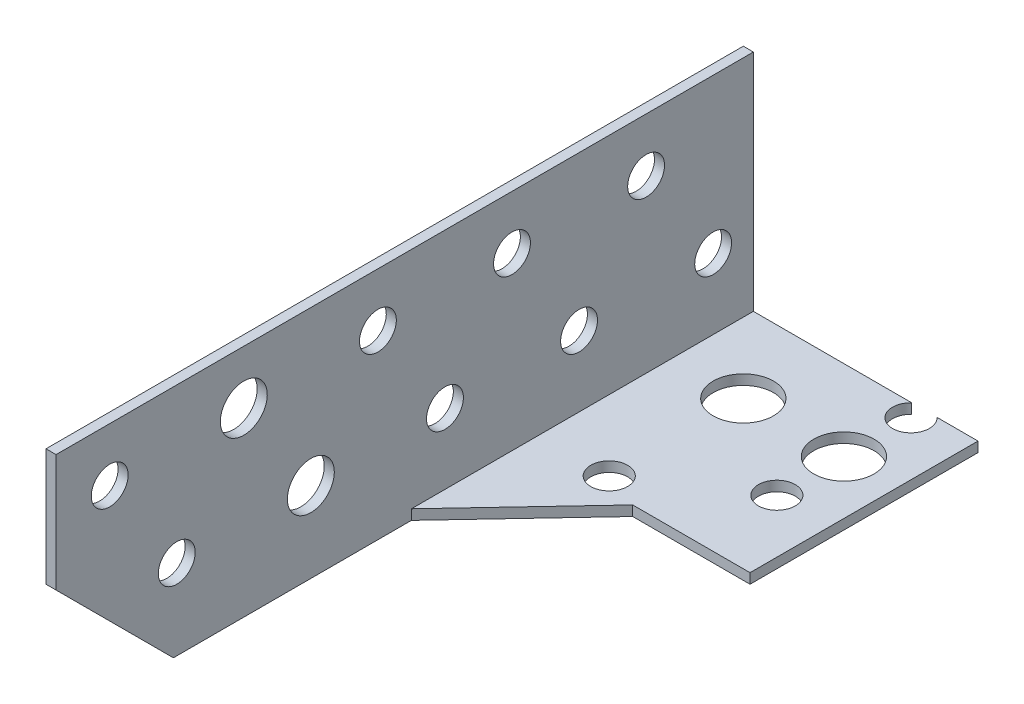
ISO-10303-21;
HEADER;
FILE_DESCRIPTION(('STEP AP214'),'2;1');
FILE_NAME('part.step','',(''),(''),'','','');
FILE_SCHEMA(('AUTOMOTIVE_DESIGN { 1 0 10303 214 1 1 1 1 }'));
ENDSEC;
DATA;
#1=APPLICATION_CONTEXT('core data for automotive mechanical design processes');
#2=APPLICATION_PROTOCOL_DEFINITION('international standard','automotive_design',2000,#1);
#3=PRODUCT_CONTEXT('',#1,'mechanical');
#4=PRODUCT('Part','Part','',(#3));
#5=PRODUCT_RELATED_PRODUCT_CATEGORY('part','',(#4));
#6=PRODUCT_DEFINITION_FORMATION('','',#4);
#7=PRODUCT_DEFINITION_CONTEXT('part definition',#1,'design');
#8=PRODUCT_DEFINITION('design','',#6,#7);
#9=PRODUCT_DEFINITION_SHAPE('','',#8);
#10=(LENGTH_UNIT() NAMED_UNIT(*) SI_UNIT(.MILLI.,.METRE.));
#11=(NAMED_UNIT(*) PLANE_ANGLE_UNIT() SI_UNIT($,.RADIAN.));
#12=(NAMED_UNIT(*) SI_UNIT($,.STERADIAN.) SOLID_ANGLE_UNIT());
#13=UNCERTAINTY_MEASURE_WITH_UNIT(LENGTH_MEASURE(1.E-05),#10,'distance_accuracy_value','');
#14=(GEOMETRIC_REPRESENTATION_CONTEXT(3) GLOBAL_UNCERTAINTY_ASSIGNED_CONTEXT((#13)) GLOBAL_UNIT_ASSIGNED_CONTEXT((#10,
#11,#12)) REPRESENTATION_CONTEXT('',''));
#15=CARTESIAN_POINT('',(0.,0.,0.));
#16=DIRECTION('',(0.,0.,1.));
#17=DIRECTION('',(1.,0.,0.));
#18=AXIS2_PLACEMENT_3D('',#15,#16,#17);
#19=CARTESIAN_POINT('',(52.75,0.,210.));
#20=DIRECTION('',(0.,-0.707106781186547,0.707106781186548));
#21=DIRECTION('',(0.,-0.707106781186548,-0.707106781186547));
#22=AXIS2_PLACEMENT_3D('',#19,#20,#21);
#23=PLANE('',#22);
#24=DIRECTION('',(0.,-0.707106781186548,-0.707106781186547));
#25=VECTOR('',#24,1.);
#26=CARTESIAN_POINT('',(-0.75,0.,210.));
#27=LINE('',#26,#25);
#28=CARTESIAN_POINT('',(-0.750000000000001,0.,210.));
#29=VERTEX_POINT('',#28);
#30=CARTESIAN_POINT('',(-0.750000000000001,-17.5,192.5));
#31=VERTEX_POINT('',#30);
#32=EDGE_CURVE('E331',#29,#31,#27,.T.);
#33=ORIENTED_EDGE('',*,*,#32,.T.);
#34=DIRECTION('',(-1.,0.,0.));
#35=VECTOR('',#34,1.);
#36=CARTESIAN_POINT('',(52.75,-17.5,192.5));
#37=LINE('',#36,#35);
#38=CARTESIAN_POINT('',(0.750000000000001,-17.5,192.5));
#39=VERTEX_POINT('',#38);
#40=EDGE_CURVE('E323',#39,#31,#37,.T.);
#41=ORIENTED_EDGE('',*,*,#40,.F.);
#42=DIRECTION('',(0.,-0.707106781186548,-0.707106781186547));
#43=VECTOR('',#42,1.);
#44=CARTESIAN_POINT('',(0.75,0.,210.));
#45=LINE('',#44,#43);
#46=CARTESIAN_POINT('',(0.75,0.,210.));
#47=VERTEX_POINT('',#46);
#48=EDGE_CURVE('E327',#47,#39,#45,.T.);
#49=ORIENTED_EDGE('',*,*,#48,.F.);
#50=DIRECTION('',(1.,0.,0.));
#51=VECTOR('',#50,1.);
#52=CARTESIAN_POINT('',(0.,0.,210.));
#53=LINE('',#52,#51);
#54=EDGE_CURVE('E187',#29,#47,#53,.T.);
#55=ORIENTED_EDGE('',*,*,#54,.F.);
#56=EDGE_LOOP('',(#33,#41,#49,#55));
#57=FACE_BOUND('',#56,.T.);
#58=ADVANCED_FACE('F46',(#57),#23,.T.);
#59=CARTESIAN_POINT('',(-51.25,9.50000000000085,122.));
#60=DIRECTION('',(1.,0.,0.));
#61=DIRECTION('',(0.,1.,0.));
#62=AXIS2_PLACEMENT_3D('',#59,#60,#61);
#63=CYLINDRICAL_SURFACE('',#62,2.75000000000002);
#64=CARTESIAN_POINT('',(0.749999999999999,9.50000000000086,122.));
#65=DIRECTION('',(1.,0.,0.));
#66=DIRECTION('',(0.,-1.,0.));
#67=AXIS2_PLACEMENT_3D('',#64,#65,#66);
#68=CIRCLE('',#67,2.75000000000002);
#69=CARTESIAN_POINT('',(0.749999999999999,6.75000000000084,122.));
#70=VERTEX_POINT('',#69);
#71=EDGE_CURVE('E259',#70,#70,#68,.T.);
#72=ORIENTED_EDGE('',*,*,#71,.T.);
#73=EDGE_LOOP('',(#72));
#74=FACE_BOUND('',#73,.T.);
#75=CARTESIAN_POINT('',(-0.750000000000001,9.50000000000086,122.));
#76=DIRECTION('',(1.,0.,0.));
#77=DIRECTION('',(0.,1.,0.));
#78=AXIS2_PLACEMENT_3D('',#75,#76,#77);
#79=CIRCLE('',#78,2.75000000000002);
#80=CARTESIAN_POINT('',(-0.750000000000001,12.2500000000009,122.));
#81=VERTEX_POINT('',#80);
#82=EDGE_CURVE('E319',#81,#81,#79,.T.);
#83=ORIENTED_EDGE('',*,*,#82,.F.);
#84=EDGE_LOOP('',(#83));
#85=FACE_BOUND('',#84,.T.);
#86=ADVANCED_FACE('F406',(#74,#85),#63,.F.);
#87=CARTESIAN_POINT('',(-51.25,9.50000000000066,142.));
#88=DIRECTION('',(1.,0.,0.));
#89=DIRECTION('',(0.,1.,0.));
#90=AXIS2_PLACEMENT_3D('',#87,#88,#89);
#91=CYLINDRICAL_SURFACE('',#90,2.75000000000004);
#92=CARTESIAN_POINT('',(0.749999999999999,9.50000000000066,142.));
#93=DIRECTION('',(1.,0.,0.));
#94=DIRECTION('',(0.,-1.,0.));
#95=AXIS2_PLACEMENT_3D('',#92,#93,#94);
#96=CIRCLE('',#95,2.75000000000004);
#97=CARTESIAN_POINT('',(0.749999999999999,6.75000000000063,142.));
#98=VERTEX_POINT('',#97);
#99=EDGE_CURVE('E265',#98,#98,#96,.T.);
#100=ORIENTED_EDGE('',*,*,#99,.T.);
#101=EDGE_LOOP('',(#100));
#102=FACE_BOUND('',#101,.T.);
#103=CARTESIAN_POINT('',(-0.750000000000001,9.50000000000066,142.));
#104=DIRECTION('',(1.,0.,0.));
#105=DIRECTION('',(0.,1.,0.));
#106=AXIS2_PLACEMENT_3D('',#103,#104,#105);
#107=CIRCLE('',#106,2.75000000000004);
#108=CARTESIAN_POINT('',(-0.750000000000001,12.2500000000007,142.));
#109=VERTEX_POINT('',#108);
#110=EDGE_CURVE('E315',#109,#109,#107,.T.);
#111=ORIENTED_EDGE('',*,*,#110,.F.);
#112=EDGE_LOOP('',(#111));
#113=FACE_BOUND('',#112,.T.);
#114=ADVANCED_FACE('F412',(#102,#113),#91,.F.);
#115=CARTESIAN_POINT('',(-51.25,9.50000000000043,162.));
#116=DIRECTION('',(1.,0.,0.));
#117=DIRECTION('',(0.,1.,0.));
#118=AXIS2_PLACEMENT_3D('',#115,#116,#117);
#119=CYLINDRICAL_SURFACE('',#118,2.75000000000004);
#120=CARTESIAN_POINT('',(0.749999999999999,9.50000000000044,162.));
#121=DIRECTION('',(1.,0.,0.));
#122=DIRECTION('',(0.,-1.,0.));
#123=AXIS2_PLACEMENT_3D('',#120,#121,#122);
#124=CIRCLE('',#123,2.75000000000004);
#125=CARTESIAN_POINT('',(0.749999999999999,6.7500000000004,162.));
#126=VERTEX_POINT('',#125);
#127=EDGE_CURVE('E260',#126,#126,#124,.T.);
#128=ORIENTED_EDGE('',*,*,#127,.T.);
#129=EDGE_LOOP('',(#128));
#130=FACE_BOUND('',#129,.T.);
#131=CARTESIAN_POINT('',(-0.750000000000001,9.50000000000044,162.));
#132=DIRECTION('',(1.,0.,0.));
#133=DIRECTION('',(0.,1.,0.));
#134=AXIS2_PLACEMENT_3D('',#131,#132,#133);
#135=CIRCLE('',#134,2.75000000000004);
#136=CARTESIAN_POINT('',(-0.750000000000001,12.2500000000005,162.));
#137=VERTEX_POINT('',#136);
#138=EDGE_CURVE('E311',#137,#137,#135,.T.);
#139=ORIENTED_EDGE('',*,*,#138,.F.);
#140=EDGE_LOOP('',(#139));
#141=FACE_BOUND('',#140,.T.);
#142=ADVANCED_FACE('F420',(#130,#141),#119,.F.);
#143=CARTESIAN_POINT('',(-51.25,9.49999999999999,202.));
#144=DIRECTION('',(1.,0.,0.));
#145=DIRECTION('',(0.,1.,0.));
#146=AXIS2_PLACEMENT_3D('',#143,#144,#145);
#147=CYLINDRICAL_SURFACE('',#146,2.75000000000004);
#148=CARTESIAN_POINT('',(0.749999999999999,9.5,202.));
#149=DIRECTION('',(1.,0.,0.));
#150=DIRECTION('',(0.,-1.,0.));
#151=AXIS2_PLACEMENT_3D('',#148,#149,#150);
#152=CIRCLE('',#151,2.75000000000004);
#153=CARTESIAN_POINT('',(0.749999999999999,6.74999999999996,202.));
#154=VERTEX_POINT('',#153);
#155=EDGE_CURVE('E264',#154,#154,#152,.T.);
#156=ORIENTED_EDGE('',*,*,#155,.T.);
#157=EDGE_LOOP('',(#156));
#158=FACE_BOUND('',#157,.T.);
#159=CARTESIAN_POINT('',(-0.750000000000001,9.5,202.));
#160=DIRECTION('',(1.,0.,0.));
#161=DIRECTION('',(0.,1.,0.));
#162=AXIS2_PLACEMENT_3D('',#159,#160,#161);
#163=CIRCLE('',#162,2.75000000000004);
#164=CARTESIAN_POINT('',(-0.750000000000001,12.25,202.));
#165=VERTEX_POINT('',#164);
#166=EDGE_CURVE('E307',#165,#165,#163,.T.);
#167=ORIENTED_EDGE('',*,*,#166,.F.);
#168=EDGE_LOOP('',(#167));
#169=FACE_BOUND('',#168,.T.);
#170=ADVANCED_FACE('F416',(#158,#169),#147,.F.);
#171=CARTESIAN_POINT('',(-51.25,-5.49999999999964,192.));
#172=DIRECTION('',(1.,0.,0.));
#173=DIRECTION('',(0.,1.,0.));
#174=AXIS2_PLACEMENT_3D('',#171,#172,#173);
#175=CYLINDRICAL_SURFACE('',#174,2.75000000000001);
#176=CARTESIAN_POINT('',(0.750000000000001,-5.49999999999963,192.));
#177=DIRECTION('',(1.,0.,0.));
#178=DIRECTION('',(0.,1.,0.));
#179=AXIS2_PLACEMENT_3D('',#176,#177,#178);
#180=CIRCLE('',#179,2.75000000000001);
#181=CARTESIAN_POINT('',(0.75,-2.74999999999963,192.));
#182=VERTEX_POINT('',#181);
#183=EDGE_CURVE('E285',#182,#182,#180,.T.);
#184=ORIENTED_EDGE('',*,*,#183,.T.);
#185=EDGE_LOOP('',(#184));
#186=FACE_BOUND('',#185,.T.);
#187=CARTESIAN_POINT('',(-0.750000000000001,-5.49999999999963,192.));
#188=DIRECTION('',(1.,0.,0.));
#189=DIRECTION('',(0.,1.,0.));
#190=AXIS2_PLACEMENT_3D('',#187,#188,#189);
#191=CIRCLE('',#190,2.75000000000001);
#192=CARTESIAN_POINT('',(-0.750000000000001,-2.74999999999963,192.));
#193=VERTEX_POINT('',#192);
#194=EDGE_CURVE('E303',#193,#193,#191,.T.);
#195=ORIENTED_EDGE('',*,*,#194,.F.);
#196=EDGE_LOOP('',(#195));
#197=FACE_BOUND('',#196,.T.);
#198=ADVANCED_FACE('F419',(#186,#197),#175,.F.);
#199=CARTESIAN_POINT('',(-51.25,-5.49999999999963,152.));
#200=DIRECTION('',(1.,0.,0.));
#201=DIRECTION('',(0.,1.,0.));
#202=AXIS2_PLACEMENT_3D('',#199,#200,#201);
#203=CYLINDRICAL_SURFACE('',#202,2.75000000000001);
#204=CARTESIAN_POINT('',(0.750000000000001,-5.49999999999963,152.));
#205=DIRECTION('',(1.,0.,0.));
#206=DIRECTION('',(0.,1.,0.));
#207=AXIS2_PLACEMENT_3D('',#204,#205,#206);
#208=CIRCLE('',#207,2.75000000000001);
#209=CARTESIAN_POINT('',(0.75,-2.74999999999962,152.));
#210=VERTEX_POINT('',#209);
#211=EDGE_CURVE('E281',#210,#210,#208,.T.);
#212=ORIENTED_EDGE('',*,*,#211,.T.);
#213=EDGE_LOOP('',(#212));
#214=FACE_BOUND('',#213,.T.);
#215=CARTESIAN_POINT('',(-0.750000000000001,-5.49999999999963,152.));
#216=DIRECTION('',(1.,0.,0.));
#217=DIRECTION('',(0.,1.,0.));
#218=AXIS2_PLACEMENT_3D('',#215,#216,#217);
#219=CIRCLE('',#218,2.75000000000001);
#220=CARTESIAN_POINT('',(-0.750000000000001,-2.74999999999962,152.));
#221=VERTEX_POINT('',#220);
#222=EDGE_CURVE('E299',#221,#221,#219,.T.);
#223=ORIENTED_EDGE('',*,*,#222,.F.);
#224=EDGE_LOOP('',(#223));
#225=FACE_BOUND('',#224,.T.);
#226=ADVANCED_FACE('F424',(#214,#225),#203,.F.);
#227=CARTESIAN_POINT('',(-51.25,-5.49999999999963,132.));
#228=DIRECTION('',(1.,0.,0.));
#229=DIRECTION('',(0.,1.,0.));
#230=AXIS2_PLACEMENT_3D('',#227,#228,#229);
#231=CYLINDRICAL_SURFACE('',#230,2.75000000000001);
#232=CARTESIAN_POINT('',(0.750000000000001,-5.49999999999962,132.));
#233=DIRECTION('',(1.,0.,0.));
#234=DIRECTION('',(0.,1.,0.));
#235=AXIS2_PLACEMENT_3D('',#232,#233,#234);
#236=CIRCLE('',#235,2.75000000000001);
#237=CARTESIAN_POINT('',(0.75,-2.74999999999961,132.));
#238=VERTEX_POINT('',#237);
#239=EDGE_CURVE('E277',#238,#238,#236,.T.);
#240=ORIENTED_EDGE('',*,*,#239,.T.);
#241=EDGE_LOOP('',(#240));
#242=FACE_BOUND('',#241,.T.);
#243=CARTESIAN_POINT('',(-0.750000000000001,-5.49999999999962,132.));
#244=DIRECTION('',(1.,0.,0.));
#245=DIRECTION('',(0.,1.,0.));
#246=AXIS2_PLACEMENT_3D('',#243,#244,#245);
#247=CIRCLE('',#246,2.75000000000001);
#248=CARTESIAN_POINT('',(-0.750000000000001,-2.74999999999961,132.));
#249=VERTEX_POINT('',#248);
#250=EDGE_CURVE('E295',#249,#249,#247,.T.);
#251=ORIENTED_EDGE('',*,*,#250,.F.);
#252=EDGE_LOOP('',(#251));
#253=FACE_BOUND('',#252,.T.);
#254=ADVANCED_FACE('F428',(#242,#253),#231,.F.);
#255=CARTESIAN_POINT('',(-51.25,-5.49999999999962,112.));
#256=DIRECTION('',(1.,0.,0.));
#257=DIRECTION('',(0.,1.,0.));
#258=AXIS2_PLACEMENT_3D('',#255,#256,#257);
#259=CYLINDRICAL_SURFACE('',#258,2.74999999999998);
#260=CARTESIAN_POINT('',(0.750000000000001,-5.49999999999962,112.));
#261=DIRECTION('',(1.,0.,0.));
#262=DIRECTION('',(0.,1.,0.));
#263=AXIS2_PLACEMENT_3D('',#260,#261,#262);
#264=CIRCLE('',#263,2.74999999999998);
#265=CARTESIAN_POINT('',(0.75,-2.74999999999964,112.));
#266=VERTEX_POINT('',#265);
#267=EDGE_CURVE('E272',#266,#266,#264,.T.);
#268=ORIENTED_EDGE('',*,*,#267,.T.);
#269=EDGE_LOOP('',(#268));
#270=FACE_BOUND('',#269,.T.);
#271=CARTESIAN_POINT('',(-0.750000000000001,-5.49999999999962,112.));
#272=DIRECTION('',(1.,0.,0.));
#273=DIRECTION('',(0.,1.,0.));
#274=AXIS2_PLACEMENT_3D('',#271,#272,#273);
#275=CIRCLE('',#274,2.74999999999998);
#276=CARTESIAN_POINT('',(-0.750000000000001,-2.74999999999964,112.));
#277=VERTEX_POINT('',#276);
#278=EDGE_CURVE('E276',#277,#277,#275,.T.);
#279=ORIENTED_EDGE('',*,*,#278,.F.);
#280=EDGE_LOOP('',(#279));
#281=FACE_BOUND('',#280,.T.);
#282=ADVANCED_FACE('F403',(#270,#281),#259,.F.);
#283=CARTESIAN_POINT('',(0.,0.,210.));
#284=DIRECTION('',(0.,0.,1.));
#285=DIRECTION('',(1.,0.,0.));
#286=AXIS2_PLACEMENT_3D('',#283,#284,#285);
#287=PLANE('',#286);
#288=DIRECTION('',(0.,-1.,0.));
#289=VECTOR('',#288,1.);
#290=CARTESIAN_POINT('',(-0.75,0.,210.));
#291=LINE('',#290,#289);
#292=CARTESIAN_POINT('',(-0.750000000000002,17.5,210.));
#293=VERTEX_POINT('',#292);
#294=EDGE_CURVE('E156',#293,#29,#291,.T.);
#295=ORIENTED_EDGE('',*,*,#294,.T.);
#296=ORIENTED_EDGE('',*,*,#54,.T.);
#297=DIRECTION('',(0.,-1.,0.));
#298=VECTOR('',#297,1.);
#299=CARTESIAN_POINT('',(0.75,0.,210.));
#300=LINE('',#299,#298);
#301=CARTESIAN_POINT('',(0.749999999999998,17.5,210.));
#302=VERTEX_POINT('',#301);
#303=EDGE_CURVE('E165',#302,#47,#300,.T.);
#304=ORIENTED_EDGE('',*,*,#303,.F.);
#305=DIRECTION('',(1.,0.,0.));
#306=VECTOR('',#305,1.);
#307=CARTESIAN_POINT('',(0.,17.5,210.));
#308=LINE('',#307,#306);
#309=EDGE_CURVE('E159',#293,#302,#308,.T.);
#310=ORIENTED_EDGE('',*,*,#309,.F.);
#311=EDGE_LOOP('',(#295,#296,#304,#310));
#312=FACE_BOUND('',#311,.T.);
#313=ADVANCED_FACE('F366',(#312),#287,.T.);
#314=CARTESIAN_POINT('',(0.,-68.,140.));
#315=DIRECTION('',(0.,0.,1.));
#316=DIRECTION('',(1.,0.,0.));
#317=AXIS2_PLACEMENT_3D('',#314,#315,#316);
#318=PLANE('',#317);
#319=DIRECTION('',(1.,0.,0.));
#320=VECTOR('',#319,1.);
#321=CARTESIAN_POINT('',(0.,-17.5,140.));
#322=LINE('',#321,#320);
#323=CARTESIAN_POINT('',(16.75,-17.5,140.));
#324=VERTEX_POINT('',#323);
#325=CARTESIAN_POINT('',(34.25,-17.5,140.));
#326=VERTEX_POINT('',#325);
#327=EDGE_CURVE('E356',#324,#326,#322,.T.);
#328=ORIENTED_EDGE('',*,*,#327,.T.);
#329=DIRECTION('',(0.,1.,0.));
#330=VECTOR('',#329,1.);
#331=CARTESIAN_POINT('',(34.25,-68.,140.));
#332=LINE('',#331,#330);
#333=CARTESIAN_POINT('',(34.25,-16.,140.));
#334=VERTEX_POINT('',#333);
#335=EDGE_CURVE('E335',#326,#334,#332,.T.);
#336=ORIENTED_EDGE('',*,*,#335,.T.);
#337=DIRECTION('',(1.,0.,0.));
#338=VECTOR('',#337,1.);
#339=CARTESIAN_POINT('',(0.,-16.,140.));
#340=LINE('',#339,#338);
#341=CARTESIAN_POINT('',(16.75,-16.,140.));
#342=VERTEX_POINT('',#341);
#343=EDGE_CURVE('E183',#342,#334,#340,.T.);
#344=ORIENTED_EDGE('',*,*,#343,.F.);
#345=DIRECTION('',(0.,1.,0.));
#346=VECTOR('',#345,1.);
#347=CARTESIAN_POINT('',(16.75,-68.,140.));
#348=LINE('',#347,#346);
#349=EDGE_CURVE('E334',#324,#342,#348,.T.);
#350=ORIENTED_EDGE('',*,*,#349,.F.);
#351=EDGE_LOOP('',(#328,#336,#344,#350));
#352=FACE_BOUND('',#351,.T.);
#353=ADVANCED_FACE('F392',(#352),#318,.T.);
#354=CARTESIAN_POINT('',(78.7536697247707,-68.,74.1211009174312));
#355=DIRECTION('',(-0.728199992692803,0.,-0.685364699004991));
#356=DIRECTION('',(-0.685364699004991,0.,0.728199992692803));
#357=AXIS2_PLACEMENT_3D('',#354,#355,#356);
#358=PLANE('',#357);
#359=ORIENTED_EDGE('',*,*,#349,.T.);
#360=DIRECTION('',(-0.685364699004991,0.,0.728199992692803));
#361=VECTOR('',#360,1.);
#362=CARTESIAN_POINT('',(-26.0536697247706,-16.,185.478899082569));
#363=LINE('',#362,#361);
#364=CARTESIAN_POINT('',(0.750000000000001,-16.,157.));
#365=VERTEX_POINT('',#364);
#366=EDGE_CURVE('E349',#342,#365,#363,.T.);
#367=ORIENTED_EDGE('',*,*,#366,.T.);
#368=DIRECTION('',(0.,1.,0.));
#369=VECTOR('',#368,1.);
#370=CARTESIAN_POINT('',(0.750000000000001,-68.,157.));
#371=LINE('',#370,#369);
#372=CARTESIAN_POINT('',(0.750000000000001,-17.5,157.));
#373=VERTEX_POINT('',#372);
#374=EDGE_CURVE('E339',#373,#365,#371,.T.);
#375=ORIENTED_EDGE('',*,*,#374,.F.);
#376=DIRECTION('',(-0.685364699004991,0.,0.728199992692803));
#377=VECTOR('',#376,1.);
#378=CARTESIAN_POINT('',(-26.0536697247706,-17.5,185.478899082569));
#379=LINE('',#378,#377);
#380=EDGE_CURVE('E352',#324,#373,#379,.T.);
#381=ORIENTED_EDGE('',*,*,#380,.F.);
#382=EDGE_LOOP('',(#359,#367,#375,#381));
#383=FACE_BOUND('',#382,.T.);
#384=ADVANCED_FACE('F375',(#383),#358,.F.);
#385=CARTESIAN_POINT('',(11.2500000000009,-68.,138.));
#386=DIRECTION('',(0.,1.,0.));
#387=DIRECTION('',(0.,0.,1.));
#388=AXIS2_PLACEMENT_3D('',#385,#386,#387);
#389=CYLINDRICAL_SURFACE('',#388,2.75000000000004);
#390=CARTESIAN_POINT('',(11.2500000000009,-16.,138.));
#391=DIRECTION('',(0.,1.,0.));
#392=DIRECTION('',(0.,0.,-1.));
#393=AXIS2_PLACEMENT_3D('',#390,#391,#392);
#394=CIRCLE('',#393,2.75000000000004);
#395=CARTESIAN_POINT('',(11.2500000000009,-16.,135.25));
#396=VERTEX_POINT('',#395);
#397=EDGE_CURVE('E152',#396,#396,#394,.T.);
#398=ORIENTED_EDGE('',*,*,#397,.T.);
#399=EDGE_LOOP('',(#398));
#400=FACE_BOUND('',#399,.T.);
#401=CARTESIAN_POINT('',(11.2500000000009,-17.5,138.));
#402=DIRECTION('',(0.,1.,0.));
#403=DIRECTION('',(0.,0.,1.));
#404=AXIS2_PLACEMENT_3D('',#401,#402,#403);
#405=CIRCLE('',#404,2.75000000000004);
#406=CARTESIAN_POINT('',(11.2500000000009,-17.5,140.75));
#407=VERTEX_POINT('',#406);
#408=EDGE_CURVE('E255',#407,#407,#405,.T.);
#409=ORIENTED_EDGE('',*,*,#408,.F.);
#410=EDGE_LOOP('',(#409));
#411=FACE_BOUND('',#410,.T.);
#412=ADVANCED_FACE('F400',(#400,#411),#389,.F.);
#413=CARTESIAN_POINT('',(26.25,-68.,128.));
#414=DIRECTION('',(0.,1.,0.));
#415=DIRECTION('',(0.,0.,1.));
#416=AXIS2_PLACEMENT_3D('',#413,#414,#415);
#417=CYLINDRICAL_SURFACE('',#416,2.75);
#418=CARTESIAN_POINT('',(26.25,-16.,128.));
#419=DIRECTION('',(0.,1.,0.));
#420=DIRECTION('',(0.,0.,1.));
#421=AXIS2_PLACEMENT_3D('',#418,#419,#420);
#422=CIRCLE('',#421,2.75);
#423=CARTESIAN_POINT('',(26.25,-16.,130.75));
#424=VERTEX_POINT('',#423);
#425=EDGE_CURVE('E241',#424,#424,#422,.T.);
#426=ORIENTED_EDGE('',*,*,#425,.T.);
#427=EDGE_LOOP('',(#426));
#428=FACE_BOUND('',#427,.T.);
#429=CARTESIAN_POINT('',(26.25,-17.5,128.));
#430=DIRECTION('',(0.,1.,0.));
#431=DIRECTION('',(0.,0.,1.));
#432=AXIS2_PLACEMENT_3D('',#429,#430,#431);
#433=CIRCLE('',#432,2.75);
#434=CARTESIAN_POINT('',(26.25,-17.5,130.75));
#435=VERTEX_POINT('',#434);
#436=EDGE_CURVE('E251',#435,#435,#433,.T.);
#437=ORIENTED_EDGE('',*,*,#436,.F.);
#438=EDGE_LOOP('',(#437));
#439=FACE_BOUND('',#438,.T.);
#440=ADVANCED_FACE('F444',(#428,#439),#417,.F.);
#441=CARTESIAN_POINT('',(0.,17.5,210.));
#442=DIRECTION('',(0.,1.,0.));
#443=DIRECTION('',(0.,0.,1.));
#444=AXIS2_PLACEMENT_3D('',#441,#442,#443);
#445=PLANE('',#444);
#446=DIRECTION('',(0.,0.,-1.));
#447=VECTOR('',#446,1.);
#448=CARTESIAN_POINT('',(0.749999999999998,17.5,210.));
#449=LINE('',#448,#447);
#450=CARTESIAN_POINT('',(0.749999999999998,17.5,106.));
#451=VERTEX_POINT('',#450);
#452=EDGE_CURVE('E150',#302,#451,#449,.T.);
#453=ORIENTED_EDGE('',*,*,#452,.T.);
#454=DIRECTION('',(-1.,0.,0.));
#455=VECTOR('',#454,1.);
#456=CARTESIAN_POINT('',(0.,17.5,106.));
#457=LINE('',#456,#455);
#458=CARTESIAN_POINT('',(-0.750000000000002,17.5,106.));
#459=VERTEX_POINT('',#458);
#460=EDGE_CURVE('E132',#451,#459,#457,.T.);
#461=ORIENTED_EDGE('',*,*,#460,.T.);
#462=DIRECTION('',(0.,0.,-1.));
#463=VECTOR('',#462,1.);
#464=CARTESIAN_POINT('',(-0.750000000000002,17.5,210.));
#465=LINE('',#464,#463);
#466=EDGE_CURVE('E148',#293,#459,#465,.T.);
#467=ORIENTED_EDGE('',*,*,#466,.F.);
#468=ORIENTED_EDGE('',*,*,#309,.T.);
#469=EDGE_LOOP('',(#453,#461,#467,#468));
#470=FACE_BOUND('',#469,.T.);
#471=ADVANCED_FACE('F146',(#470),#445,.T.);
#472=CARTESIAN_POINT('',(26.25,-68.,108.));
#473=DIRECTION('',(0.,1.,0.));
#474=DIRECTION('',(0.,0.,1.));
#475=AXIS2_PLACEMENT_3D('',#472,#473,#474);
#476=CYLINDRICAL_SURFACE('',#475,2.75);
#477=DIRECTION('',(0.,1.,0.));
#478=VECTOR('',#477,1.);
#479=CARTESIAN_POINT('',(24.3625413911823,-68.,106.));
#480=LINE('',#479,#478);
#481=CARTESIAN_POINT('',(24.3625413911823,-16.,106.));
#482=VERTEX_POINT('',#481);
#483=CARTESIAN_POINT('',(24.3625413911823,-17.5,106.));
#484=VERTEX_POINT('',#483);
#485=EDGE_CURVE('E11',#482,#484,#480,.F.);
#486=ORIENTED_EDGE('',*,*,#485,.F.);
#487=CARTESIAN_POINT('',(26.25,-16.,108.));
#488=DIRECTION('',(0.,1.,0.));
#489=DIRECTION('',(0.,0.,1.));
#490=AXIS2_PLACEMENT_3D('',#487,#488,#489);
#491=CIRCLE('',#490,2.75);
#492=CARTESIAN_POINT('',(28.1374586088177,-16.,106.));
#493=VERTEX_POINT('',#492);
#494=EDGE_CURVE('E236',#482,#493,#491,.T.);
#495=ORIENTED_EDGE('',*,*,#494,.T.);
#496=DIRECTION('',(0.,1.,0.));
#497=VECTOR('',#496,1.);
#498=CARTESIAN_POINT('',(28.1374586088177,-68.,106.));
#499=LINE('',#498,#497);
#500=CARTESIAN_POINT('',(28.1374586088177,-17.5,106.));
#501=VERTEX_POINT('',#500);
#502=EDGE_CURVE('E56',#501,#493,#499,.T.);
#503=ORIENTED_EDGE('',*,*,#502,.F.);
#504=CARTESIAN_POINT('',(26.25,-17.5,108.));
#505=DIRECTION('',(0.,1.,0.));
#506=DIRECTION('',(0.,0.,1.));
#507=AXIS2_PLACEMENT_3D('',#504,#505,#506);
#508=CIRCLE('',#507,2.75);
#509=EDGE_CURVE('E240',#484,#501,#508,.T.);
#510=ORIENTED_EDGE('',*,*,#509,.F.);
#511=EDGE_LOOP('',(#486,#495,#503,#510));
#512=FACE_BOUND('',#511,.T.);
#513=ADVANCED_FACE('F385',(#512),#476,.F.);
#514=CARTESIAN_POINT('',(0.,-16.,210.));
#515=DIRECTION('',(0.,1.,0.));
#516=DIRECTION('',(0.,0.,1.));
#517=AXIS2_PLACEMENT_3D('',#514,#515,#516);
#518=PLANE('',#517);
#519=CARTESIAN_POINT('',(11.2500000000003,-16.,118.));
#520=DIRECTION('',(0.,1.,0.));
#521=DIRECTION('',(0.,0.,1.));
#522=AXIS2_PLACEMENT_3D('',#519,#520,#521);
#523=CIRCLE('',#522,4.5);
#524=CARTESIAN_POINT('',(11.2500000000003,-16.,122.5));
#525=VERTEX_POINT('',#524);
#526=EDGE_CURVE('E198',#525,#525,#523,.T.);
#527=ORIENTED_EDGE('',*,*,#526,.F.);
#528=EDGE_LOOP('',(#527));
#529=FACE_BOUND('',#528,.T.);
#530=CARTESIAN_POINT('',(26.25,-16.,118.));
#531=DIRECTION('',(0.,1.,0.));
#532=DIRECTION('',(0.,0.,1.));
#533=AXIS2_PLACEMENT_3D('',#530,#531,#532);
#534=CIRCLE('',#533,4.5);
#535=CARTESIAN_POINT('',(26.25,-16.,122.5));
#536=VERTEX_POINT('',#535);
#537=EDGE_CURVE('E210',#536,#536,#534,.T.);
#538=ORIENTED_EDGE('',*,*,#537,.F.);
#539=EDGE_LOOP('',(#538));
#540=FACE_BOUND('',#539,.T.);
#541=ORIENTED_EDGE('',*,*,#425,.F.);
#542=EDGE_LOOP('',(#541));
#543=FACE_BOUND('',#542,.T.);
#544=ORIENTED_EDGE('',*,*,#397,.F.);
#545=EDGE_LOOP('',(#544));
#546=FACE_BOUND('',#545,.T.);
#547=DIRECTION('',(0.,0.,-1.));
#548=VECTOR('',#547,1.);
#549=CARTESIAN_POINT('',(34.25,-16.,210.));
#550=LINE('',#549,#548);
#551=CARTESIAN_POINT('',(34.25,-16.,106.));
#552=VERTEX_POINT('',#551);
#553=EDGE_CURVE('E172',#334,#552,#550,.T.);
#554=ORIENTED_EDGE('',*,*,#553,.T.);
#555=DIRECTION('',(-1.,0.,0.));
#556=VECTOR('',#555,1.);
#557=CARTESIAN_POINT('',(0.,-16.,106.));
#558=LINE('',#557,#556);
#559=EDGE_CURVE('E141',#552,#493,#558,.T.);
#560=ORIENTED_EDGE('',*,*,#559,.T.);
#561=ORIENTED_EDGE('',*,*,#494,.F.);
#562=CARTESIAN_POINT('',(0.750000000000001,-16.,106.));
#563=VERTEX_POINT('',#562);
#564=EDGE_CURVE('E71',#482,#563,#558,.T.);
#565=ORIENTED_EDGE('',*,*,#564,.T.);
#566=DIRECTION('',(0.,0.,-1.));
#567=VECTOR('',#566,1.);
#568=CARTESIAN_POINT('',(0.750000000000002,-16.,210.));
#569=LINE('',#568,#567);
#570=EDGE_CURVE('E163',#365,#563,#569,.T.);
#571=ORIENTED_EDGE('',*,*,#570,.F.);
#572=ORIENTED_EDGE('',*,*,#366,.F.);
#573=ORIENTED_EDGE('',*,*,#343,.T.);
#574=EDGE_LOOP('',(#554,#560,#561,#565,#571,#572,#573));
#575=FACE_BOUND('',#574,.T.);
#576=ADVANCED_FACE('F379',(#529,#540,#543,#546,#575),#518,.T.);
#577=CARTESIAN_POINT('',(34.2500000000001,-1.58438077472549E-13,210.));
#578=DIRECTION('',(-1.,0.,0.));
#579=DIRECTION('',(0.,-1.,0.));
#580=AXIS2_PLACEMENT_3D('',#577,#578,#579);
#581=PLANE('',#580);
#582=DIRECTION('',(0.,-1.,0.));
#583=VECTOR('',#582,1.);
#584=CARTESIAN_POINT('',(34.25,36.,106.));
#585=LINE('',#584,#583);
#586=CARTESIAN_POINT('',(34.25,-17.5,106.));
#587=VERTEX_POINT('',#586);
#588=EDGE_CURVE('E142',#552,#587,#585,.T.);
#589=ORIENTED_EDGE('',*,*,#588,.F.);
#590=ORIENTED_EDGE('',*,*,#553,.F.);
#591=ORIENTED_EDGE('',*,*,#335,.F.);
#592=DIRECTION('',(0.,0.,-1.));
#593=VECTOR('',#592,1.);
#594=CARTESIAN_POINT('',(34.25,-17.5,210.));
#595=LINE('',#594,#593);
#596=EDGE_CURVE('E176',#326,#587,#595,.T.);
#597=ORIENTED_EDGE('',*,*,#596,.T.);
#598=EDGE_LOOP('',(#589,#590,#591,#597));
#599=FACE_BOUND('',#598,.T.);
#600=ADVANCED_FACE('F390',(#599),#581,.F.);
#601=CARTESIAN_POINT('',(0.75,0.,210.));
#602=DIRECTION('',(1.,0.,0.));
#603=DIRECTION('',(0.,1.,0.));
#604=AXIS2_PLACEMENT_3D('',#601,#602,#603);
#605=PLANE('',#604);
#606=CARTESIAN_POINT('',(0.749999999999999,9.50000000000023,182.));
#607=DIRECTION('',(1.,0.,0.));
#608=DIRECTION('',(0.,1.,0.));
#609=AXIS2_PLACEMENT_3D('',#606,#607,#608);
#610=CIRCLE('',#609,3.49999999999999);
#611=CARTESIAN_POINT('',(0.749999999999998,13.0000000000002,182.));
#612=VERTEX_POINT('',#611);
#613=EDGE_CURVE('E204',#612,#612,#610,.T.);
#614=ORIENTED_EDGE('',*,*,#613,.F.);
#615=EDGE_LOOP('',(#614));
#616=FACE_BOUND('',#615,.T.);
#617=CARTESIAN_POINT('',(0.750000000000001,-5.49999999999963,172.));
#618=DIRECTION('',(1.,0.,0.));
#619=DIRECTION('',(0.,1.,0.));
#620=AXIS2_PLACEMENT_3D('',#617,#618,#619);
#621=CIRCLE('',#620,3.49999999999999);
#622=CARTESIAN_POINT('',(0.75,-1.99999999999964,172.));
#623=VERTEX_POINT('',#622);
#624=EDGE_CURVE('E212',#623,#623,#621,.T.);
#625=ORIENTED_EDGE('',*,*,#624,.F.);
#626=EDGE_LOOP('',(#625));
#627=FACE_BOUND('',#626,.T.);
#628=ORIENTED_EDGE('',*,*,#267,.F.);
#629=EDGE_LOOP('',(#628));
#630=FACE_BOUND('',#629,.T.);
#631=ORIENTED_EDGE('',*,*,#239,.F.);
#632=EDGE_LOOP('',(#631));
#633=FACE_BOUND('',#632,.T.);
#634=ORIENTED_EDGE('',*,*,#211,.F.);
#635=EDGE_LOOP('',(#634));
#636=FACE_BOUND('',#635,.T.);
#637=ORIENTED_EDGE('',*,*,#183,.F.);
#638=EDGE_LOOP('',(#637));
#639=FACE_BOUND('',#638,.T.);
#640=ORIENTED_EDGE('',*,*,#155,.F.);
#641=EDGE_LOOP('',(#640));
#642=FACE_BOUND('',#641,.T.);
#643=ORIENTED_EDGE('',*,*,#127,.F.);
#644=EDGE_LOOP('',(#643));
#645=FACE_BOUND('',#644,.T.);
#646=ORIENTED_EDGE('',*,*,#99,.F.);
#647=EDGE_LOOP('',(#646));
#648=FACE_BOUND('',#647,.T.);
#649=ORIENTED_EDGE('',*,*,#71,.F.);
#650=EDGE_LOOP('',(#649));
#651=FACE_BOUND('',#650,.T.);
#652=ORIENTED_EDGE('',*,*,#570,.T.);
#653=DIRECTION('',(0.,1.,0.));
#654=VECTOR('',#653,1.);
#655=CARTESIAN_POINT('',(0.75,0.,106.));
#656=LINE('',#655,#654);
#657=EDGE_CURVE('E233',#563,#451,#656,.T.);
#658=ORIENTED_EDGE('',*,*,#657,.T.);
#659=ORIENTED_EDGE('',*,*,#452,.F.);
#660=ORIENTED_EDGE('',*,*,#303,.T.);
#661=ORIENTED_EDGE('',*,*,#48,.T.);
#662=DIRECTION('',(0.,0.,1.));
#663=VECTOR('',#662,1.);
#664=CARTESIAN_POINT('',(0.750000000000002,-17.5,210.));
#665=LINE('',#664,#663);
#666=EDGE_CURVE('E338',#373,#39,#665,.T.);
#667=ORIENTED_EDGE('',*,*,#666,.F.);
#668=ORIENTED_EDGE('',*,*,#374,.T.);
#669=EDGE_LOOP('',(#652,#658,#659,#660,#661,#667,#668));
#670=FACE_BOUND('',#669,.T.);
#671=ADVANCED_FACE('F364',(#616,#627,#630,#633,#636,#639,#642,#645,#648,#651,#670),#605,.T.);
#672=CARTESIAN_POINT('',(-0.75,0.,210.));
#673=DIRECTION('',(1.,0.,0.));
#674=DIRECTION('',(0.,1.,0.));
#675=AXIS2_PLACEMENT_3D('',#672,#673,#674);
#676=PLANE('',#675);
#677=CARTESIAN_POINT('',(-0.750000000000001,9.50000000000023,182.));
#678=DIRECTION('',(1.,0.,0.));
#679=DIRECTION('',(0.,1.,0.));
#680=AXIS2_PLACEMENT_3D('',#677,#678,#679);
#681=CIRCLE('',#680,3.49999999999999);
#682=CARTESIAN_POINT('',(-0.750000000000001,13.0000000000002,182.));
#683=VERTEX_POINT('',#682);
#684=EDGE_CURVE('E50',#683,#683,#681,.T.);
#685=ORIENTED_EDGE('',*,*,#684,.T.);
#686=EDGE_LOOP('',(#685));
#687=FACE_BOUND('',#686,.T.);
#688=CARTESIAN_POINT('',(-0.749999999999999,-5.49999999999963,172.));
#689=DIRECTION('',(1.,0.,0.));
#690=DIRECTION('',(0.,1.,0.));
#691=AXIS2_PLACEMENT_3D('',#688,#689,#690);
#692=CIRCLE('',#691,3.49999999999999);
#693=CARTESIAN_POINT('',(-0.749999999999999,-1.99999999999964,172.));
#694=VERTEX_POINT('',#693);
#695=EDGE_CURVE('E201',#694,#694,#692,.T.);
#696=ORIENTED_EDGE('',*,*,#695,.T.);
#697=EDGE_LOOP('',(#696));
#698=FACE_BOUND('',#697,.T.);
#699=ORIENTED_EDGE('',*,*,#278,.T.);
#700=EDGE_LOOP('',(#699));
#701=FACE_BOUND('',#700,.T.);
#702=ORIENTED_EDGE('',*,*,#250,.T.);
#703=EDGE_LOOP('',(#702));
#704=FACE_BOUND('',#703,.T.);
#705=ORIENTED_EDGE('',*,*,#222,.T.);
#706=EDGE_LOOP('',(#705));
#707=FACE_BOUND('',#706,.T.);
#708=ORIENTED_EDGE('',*,*,#194,.T.);
#709=EDGE_LOOP('',(#708));
#710=FACE_BOUND('',#709,.T.);
#711=ORIENTED_EDGE('',*,*,#166,.T.);
#712=EDGE_LOOP('',(#711));
#713=FACE_BOUND('',#712,.T.);
#714=ORIENTED_EDGE('',*,*,#138,.T.);
#715=EDGE_LOOP('',(#714));
#716=FACE_BOUND('',#715,.T.);
#717=ORIENTED_EDGE('',*,*,#110,.T.);
#718=EDGE_LOOP('',(#717));
#719=FACE_BOUND('',#718,.T.);
#720=ORIENTED_EDGE('',*,*,#82,.T.);
#721=EDGE_LOOP('',(#720));
#722=FACE_BOUND('',#721,.T.);
#723=DIRECTION('',(0.,-1.,0.));
#724=VECTOR('',#723,1.);
#725=CARTESIAN_POINT('',(-0.750000000000002,36.,106.));
#726=LINE('',#725,#724);
#727=CARTESIAN_POINT('',(-0.750000000000002,-17.5,106.));
#728=VERTEX_POINT('',#727);
#729=EDGE_CURVE('E129',#459,#728,#726,.T.);
#730=ORIENTED_EDGE('',*,*,#729,.T.);
#731=DIRECTION('',(0.,0.,-1.));
#732=VECTOR('',#731,1.);
#733=CARTESIAN_POINT('',(-0.749999999999997,-17.5,210.));
#734=LINE('',#733,#732);
#735=EDGE_CURVE('E180',#31,#728,#734,.T.);
#736=ORIENTED_EDGE('',*,*,#735,.F.);
#737=ORIENTED_EDGE('',*,*,#32,.F.);
#738=ORIENTED_EDGE('',*,*,#294,.F.);
#739=ORIENTED_EDGE('',*,*,#466,.T.);
#740=EDGE_LOOP('',(#730,#736,#737,#738,#739));
#741=FACE_BOUND('',#740,.T.);
#742=ADVANCED_FACE('F48',(#687,#698,#701,#704,#707,#710,#713,#716,#719,#722,#741),#676,.F.);
#743=CARTESIAN_POINT('',(0.,-17.5,210.));
#744=DIRECTION('',(0.,1.,0.));
#745=DIRECTION('',(0.,0.,1.));
#746=AXIS2_PLACEMENT_3D('',#743,#744,#745);
#747=PLANE('',#746);
#748=CARTESIAN_POINT('',(11.2500000000003,-17.5,118.));
#749=DIRECTION('',(0.,1.,0.));
#750=DIRECTION('',(0.,0.,1.));
#751=AXIS2_PLACEMENT_3D('',#748,#749,#750);
#752=CIRCLE('',#751,4.5);
#753=CARTESIAN_POINT('',(11.2500000000003,-17.5,122.5));
#754=VERTEX_POINT('',#753);
#755=EDGE_CURVE('E197',#754,#754,#752,.T.);
#756=ORIENTED_EDGE('',*,*,#755,.T.);
#757=EDGE_LOOP('',(#756));
#758=FACE_BOUND('',#757,.T.);
#759=CARTESIAN_POINT('',(26.25,-17.5,118.));
#760=DIRECTION('',(0.,1.,0.));
#761=DIRECTION('',(0.,0.,1.));
#762=AXIS2_PLACEMENT_3D('',#759,#760,#761);
#763=CIRCLE('',#762,4.5);
#764=CARTESIAN_POINT('',(26.25,-17.5,122.5));
#765=VERTEX_POINT('',#764);
#766=EDGE_CURVE('E193',#765,#765,#763,.T.);
#767=ORIENTED_EDGE('',*,*,#766,.T.);
#768=EDGE_LOOP('',(#767));
#769=FACE_BOUND('',#768,.T.);
#770=ORIENTED_EDGE('',*,*,#436,.T.);
#771=EDGE_LOOP('',(#770));
#772=FACE_BOUND('',#771,.T.);
#773=ORIENTED_EDGE('',*,*,#408,.T.);
#774=EDGE_LOOP('',(#773));
#775=FACE_BOUND('',#774,.T.);
#776=DIRECTION('',(-1.,0.,0.));
#777=VECTOR('',#776,1.);
#778=CARTESIAN_POINT('',(0.,-17.5,106.));
#779=LINE('',#778,#777);
#780=EDGE_CURVE('E64',#587,#501,#779,.T.);
#781=ORIENTED_EDGE('',*,*,#780,.F.);
#782=ORIENTED_EDGE('',*,*,#596,.F.);
#783=ORIENTED_EDGE('',*,*,#327,.F.);
#784=ORIENTED_EDGE('',*,*,#380,.T.);
#785=ORIENTED_EDGE('',*,*,#666,.T.);
#786=ORIENTED_EDGE('',*,*,#40,.T.);
#787=ORIENTED_EDGE('',*,*,#735,.T.);
#788=EDGE_CURVE('E135',#484,#728,#779,.T.);
#789=ORIENTED_EDGE('',*,*,#788,.F.);
#790=ORIENTED_EDGE('',*,*,#509,.T.);
#791=EDGE_LOOP('',(#781,#782,#783,#784,#785,#786,#787,#789,#790));
#792=FACE_BOUND('',#791,.T.);
#793=ADVANCED_FACE('F369',(#758,#769,#772,#775,#792),#747,.F.);
#794=CARTESIAN_POINT('',(34.25,36.,106.));
#795=DIRECTION('',(0.,0.,-1.));
#796=DIRECTION('',(-1.,0.,0.));
#797=AXIS2_PLACEMENT_3D('',#794,#795,#796);
#798=PLANE('',#797);
#799=ORIENTED_EDGE('',*,*,#780,.T.);
#800=ORIENTED_EDGE('',*,*,#502,.T.);
#801=ORIENTED_EDGE('',*,*,#559,.F.);
#802=ORIENTED_EDGE('',*,*,#588,.T.);
#803=EDGE_LOOP('',(#799,#800,#801,#802));
#804=FACE_BOUND('',#803,.T.);
#805=ADVANCED_FACE('F454',(#804),#798,.T.);
#806=ORIENTED_EDGE('',*,*,#657,.F.);
#807=ORIENTED_EDGE('',*,*,#564,.F.);
#808=ORIENTED_EDGE('',*,*,#485,.T.);
#809=ORIENTED_EDGE('',*,*,#788,.T.);
#810=ORIENTED_EDGE('',*,*,#729,.F.);
#811=ORIENTED_EDGE('',*,*,#460,.F.);
#812=EDGE_LOOP('',(#806,#807,#808,#809,#810,#811));
#813=FACE_BOUND('',#812,.T.);
#814=ADVANCED_FACE('F131',(#813),#798,.T.);
#815=CARTESIAN_POINT('',(26.25,-26.,118.));
#816=DIRECTION('',(0.,1.,0.));
#817=DIRECTION('',(0.,0.,1.));
#818=AXIS2_PLACEMENT_3D('',#815,#816,#817);
#819=CYLINDRICAL_SURFACE('',#818,4.5);
#820=ORIENTED_EDGE('',*,*,#537,.T.);
#821=EDGE_LOOP('',(#820));
#822=FACE_BOUND('',#821,.T.);
#823=ORIENTED_EDGE('',*,*,#766,.F.);
#824=EDGE_LOOP('',(#823));
#825=FACE_BOUND('',#824,.T.);
#826=ADVANCED_FACE('F453',(#822,#825),#819,.F.);
#827=CARTESIAN_POINT('',(11.2500000000003,-26.,118.));
#828=DIRECTION('',(0.,1.,0.));
#829=DIRECTION('',(0.,0.,1.));
#830=AXIS2_PLACEMENT_3D('',#827,#828,#829);
#831=CYLINDRICAL_SURFACE('',#830,4.5);
#832=ORIENTED_EDGE('',*,*,#526,.T.);
#833=EDGE_LOOP('',(#832));
#834=FACE_BOUND('',#833,.T.);
#835=ORIENTED_EDGE('',*,*,#755,.F.);
#836=EDGE_LOOP('',(#835));
#837=FACE_BOUND('',#836,.T.);
#838=ADVANCED_FACE('F457',(#834,#837),#831,.F.);
#839=CARTESIAN_POINT('',(-9.25,-5.49999999999963,172.));
#840=DIRECTION('',(1.,0.,0.));
#841=DIRECTION('',(0.,1.,0.));
#842=AXIS2_PLACEMENT_3D('',#839,#840,#841);
#843=CYLINDRICAL_SURFACE('',#842,3.49999999999999);
#844=ORIENTED_EDGE('',*,*,#624,.T.);
#845=EDGE_LOOP('',(#844));
#846=FACE_BOUND('',#845,.T.);
#847=ORIENTED_EDGE('',*,*,#695,.F.);
#848=EDGE_LOOP('',(#847));
#849=FACE_BOUND('',#848,.T.);
#850=ADVANCED_FACE('F461',(#846,#849),#843,.F.);
#851=CARTESIAN_POINT('',(-9.25,9.50000000000023,182.));
#852=DIRECTION('',(1.,0.,0.));
#853=DIRECTION('',(0.,1.,0.));
#854=AXIS2_PLACEMENT_3D('',#851,#852,#853);
#855=CYLINDRICAL_SURFACE('',#854,3.49999999999999);
#856=ORIENTED_EDGE('',*,*,#613,.T.);
#857=EDGE_LOOP('',(#856));
#858=FACE_BOUND('',#857,.T.);
#859=ORIENTED_EDGE('',*,*,#684,.F.);
#860=EDGE_LOOP('',(#859));
#861=FACE_BOUND('',#860,.T.);
#862=ADVANCED_FACE('F465',(#858,#861),#855,.F.);
#863=CLOSED_SHELL('',(#58,#86,#114,#142,#170,#198,#226,#254,#282,#313,#353,#384,#412,#440,#471,
#513,#576,#600,#671,#742,#793,#805,#814,#826,#838,#850,#862));
#864=MANIFOLD_SOLID_BREP('B2',#863);
#865=ADVANCED_BREP_SHAPE_REPRESENTATION('',(#18,#864),#14);
#866=SHAPE_DEFINITION_REPRESENTATION(#9,#865);
ENDSEC;
END-ISO-10303-21;
